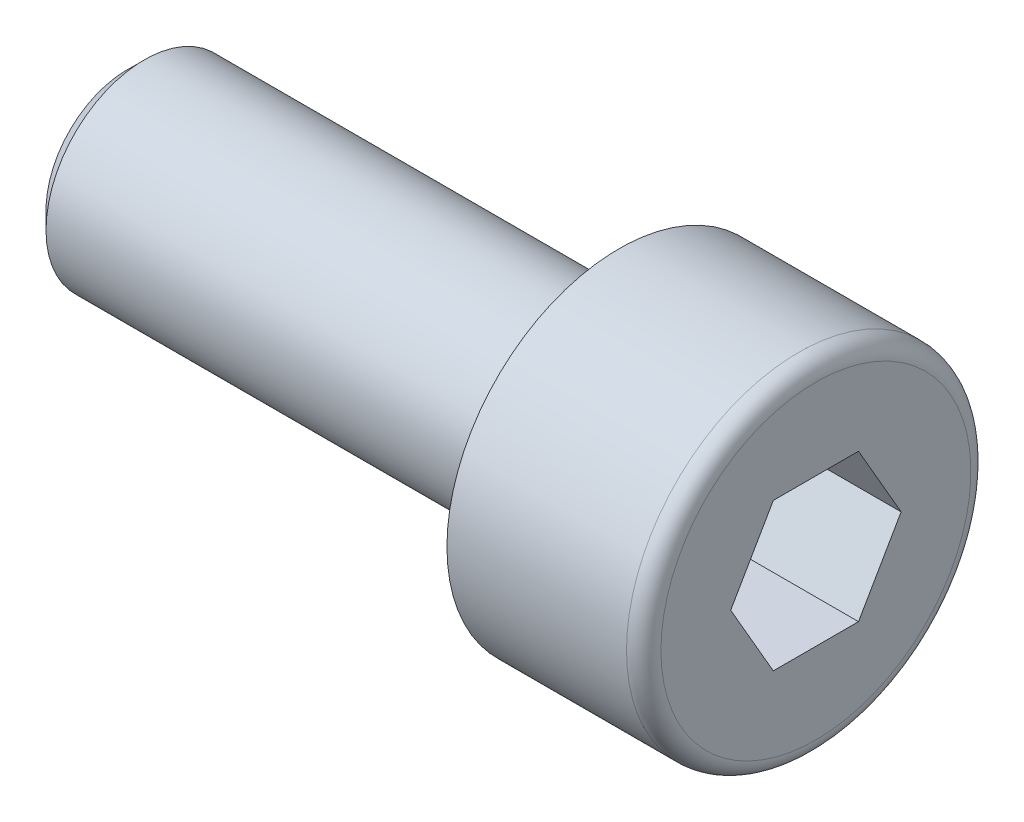
ISO-10303-21;
HEADER;
FILE_DESCRIPTION(('STEP AP214'),'2;1');
FILE_NAME('part.step','',(''),(''),'','','');
FILE_SCHEMA(('AUTOMOTIVE_DESIGN { 1 0 10303 214 1 1 1 1 }'));
ENDSEC;
DATA;
#1=APPLICATION_CONTEXT('core data for automotive mechanical design processes');
#2=APPLICATION_PROTOCOL_DEFINITION('international standard','automotive_design',2000,#1);
#3=PRODUCT_CONTEXT('',#1,'mechanical');
#4=PRODUCT('Part','Part','',(#3));
#5=PRODUCT_RELATED_PRODUCT_CATEGORY('part','',(#4));
#6=PRODUCT_DEFINITION_FORMATION('','',#4);
#7=PRODUCT_DEFINITION_CONTEXT('part definition',#1,'design');
#8=PRODUCT_DEFINITION('design','',#6,#7);
#9=PRODUCT_DEFINITION_SHAPE('','',#8);
#10=(LENGTH_UNIT() NAMED_UNIT(*) SI_UNIT(.MILLI.,.METRE.));
#11=(NAMED_UNIT(*) PLANE_ANGLE_UNIT() SI_UNIT($,.RADIAN.));
#12=(NAMED_UNIT(*) SI_UNIT($,.STERADIAN.) SOLID_ANGLE_UNIT());
#13=UNCERTAINTY_MEASURE_WITH_UNIT(LENGTH_MEASURE(1.E-05),#10,'distance_accuracy_value','');
#14=(GEOMETRIC_REPRESENTATION_CONTEXT(3) GLOBAL_UNCERTAINTY_ASSIGNED_CONTEXT((#13)) GLOBAL_UNIT_ASSIGNED_CONTEXT((#10,
#11,#12)) REPRESENTATION_CONTEXT('',''));
#15=CARTESIAN_POINT('',(0.,0.,0.));
#16=DIRECTION('',(0.,0.,1.));
#17=DIRECTION('',(1.,0.,0.));
#18=AXIS2_PLACEMENT_3D('',#15,#16,#17);
#19=CARTESIAN_POINT('',(0.,0.,0.));
#20=DIRECTION('',(-1.,0.,0.));
#21=DIRECTION('',(0.,0.,1.));
#22=AXIS2_PLACEMENT_3D('',#19,#20,#21);
#23=PLANE('',#22);
#24=DIRECTION('',(0.,0.866025403784438,0.5));
#25=VECTOR('',#24,1.);
#26=CARTESIAN_POINT('',(0.,0.,-1.73205080756888));
#27=LINE('',#26,#25);
#28=CARTESIAN_POINT('',(0.,0.,-1.73205080756888));
#29=VERTEX_POINT('',#28);
#30=CARTESIAN_POINT('',(0.,1.5,-0.866025403784438));
#31=VERTEX_POINT('',#30);
#32=EDGE_CURVE('E110',#29,#31,#27,.T.);
#33=ORIENTED_EDGE('',*,*,#32,.F.);
#34=DIRECTION('',(0.,0.866025403784438,-0.5));
#35=VECTOR('',#34,1.);
#36=CARTESIAN_POINT('',(0.,-1.5,-0.86602540378444));
#37=LINE('',#36,#35);
#38=CARTESIAN_POINT('',(0.,-1.5,-0.86602540378444));
#39=VERTEX_POINT('',#38);
#40=EDGE_CURVE('E52',#39,#29,#37,.T.);
#41=ORIENTED_EDGE('',*,*,#40,.F.);
#42=DIRECTION('',(0.,0.,-1.));
#43=VECTOR('',#42,1.);
#44=CARTESIAN_POINT('',(0.,-1.5,0.866025403784438));
#45=LINE('',#44,#43);
#46=CARTESIAN_POINT('',(0.,-1.5,0.866025403784438));
#47=VERTEX_POINT('',#46);
#48=EDGE_CURVE('E125',#47,#39,#45,.T.);
#49=ORIENTED_EDGE('',*,*,#48,.F.);
#50=DIRECTION('',(0.,-0.866025403784438,-0.5));
#51=VECTOR('',#50,1.);
#52=CARTESIAN_POINT('',(0.,0.,1.73205080756888));
#53=LINE('',#52,#51);
#54=CARTESIAN_POINT('',(0.,0.,1.73205080756888));
#55=VERTEX_POINT('',#54);
#56=EDGE_CURVE('E119',#55,#47,#53,.T.);
#57=ORIENTED_EDGE('',*,*,#56,.F.);
#58=DIRECTION('',(0.,-0.866025403784439,0.5));
#59=VECTOR('',#58,1.);
#60=CARTESIAN_POINT('',(0.,1.5,0.866025403784439));
#61=LINE('',#60,#59);
#62=CARTESIAN_POINT('',(0.,1.5,0.866025403784439));
#63=VERTEX_POINT('',#62);
#64=EDGE_CURVE('E117',#63,#55,#61,.T.);
#65=ORIENTED_EDGE('',*,*,#64,.F.);
#66=DIRECTION('',(0.,0.,1.));
#67=VECTOR('',#66,1.);
#68=CARTESIAN_POINT('',(0.,1.5,-0.866025403784438));
#69=LINE('',#68,#67);
#70=EDGE_CURVE('E103',#31,#63,#69,.T.);
#71=ORIENTED_EDGE('',*,*,#70,.F.);
#72=EDGE_LOOP('',(#33,#41,#49,#57,#65,#71));
#73=FACE_BOUND('',#72,.T.);
#74=CARTESIAN_POINT('',(0.,0.,0.));
#75=DIRECTION('',(-1.,0.,0.));
#76=DIRECTION('',(0.,0.,1.));
#77=AXIS2_PLACEMENT_3D('',#74,#75,#76);
#78=CIRCLE('',#77,3.15);
#79=CARTESIAN_POINT('',(0.,0.,3.15));
#80=VERTEX_POINT('',#79);
#81=EDGE_CURVE('E12',#80,#80,#78,.F.);
#82=ORIENTED_EDGE('',*,*,#81,.T.);
#83=EDGE_LOOP('',(#82));
#84=FACE_BOUND('',#83,.T.);
#85=ADVANCED_FACE('F37',(#73,#84),#23,.F.);
#86=CARTESIAN_POINT('',(-123.158940217391,0.,0.));
#87=DIRECTION('',(-1.,0.,0.));
#88=DIRECTION('',(0.,0.,1.));
#89=AXIS2_PLACEMENT_3D('',#86,#87,#88);
#90=CYLINDRICAL_SURFACE('',#89,3.5);
#91=CARTESIAN_POINT('',(-0.350000000000003,0.,0.));
#92=DIRECTION('',(-1.,0.,0.));
#93=DIRECTION('',(0.,0.,1.));
#94=AXIS2_PLACEMENT_3D('',#91,#92,#93);
#95=CIRCLE('',#94,3.5);
#96=CARTESIAN_POINT('',(-0.350000000000003,0.,3.5));
#97=VERTEX_POINT('',#96);
#98=EDGE_CURVE('E45',#97,#97,#95,.T.);
#99=ORIENTED_EDGE('',*,*,#98,.T.);
#100=EDGE_LOOP('',(#99));
#101=FACE_BOUND('',#100,.T.);
#102=CARTESIAN_POINT('',(-4.,0.,0.));
#103=DIRECTION('',(-1.,0.,0.));
#104=DIRECTION('',(0.,0.,1.));
#105=AXIS2_PLACEMENT_3D('',#102,#103,#104);
#106=CIRCLE('',#105,3.5);
#107=CARTESIAN_POINT('',(-4.,0.,3.5));
#108=VERTEX_POINT('',#107);
#109=EDGE_CURVE('E140',#108,#108,#106,.T.);
#110=ORIENTED_EDGE('',*,*,#109,.F.);
#111=EDGE_LOOP('',(#110));
#112=FACE_BOUND('',#111,.T.);
#113=ADVANCED_FACE('F151',(#101,#112),#90,.T.);
#114=CARTESIAN_POINT('',(-4.,3.5,0.));
#115=DIRECTION('',(1.,0.,0.));
#116=DIRECTION('',(0.,0.,-1.));
#117=AXIS2_PLACEMENT_3D('',#114,#115,#116);
#118=PLANE('',#117);
#119=CARTESIAN_POINT('',(-4.,0.,0.));
#120=DIRECTION('',(-1.,0.,0.));
#121=DIRECTION('',(0.,0.,1.));
#122=AXIS2_PLACEMENT_3D('',#119,#120,#121);
#123=CIRCLE('',#122,2.);
#124=CARTESIAN_POINT('',(-4.,0.,2.));
#125=VERTEX_POINT('',#124);
#126=EDGE_CURVE('E137',#125,#125,#123,.T.);
#127=ORIENTED_EDGE('',*,*,#126,.F.);
#128=EDGE_LOOP('',(#127));
#129=FACE_BOUND('',#128,.T.);
#130=ORIENTED_EDGE('',*,*,#109,.T.);
#131=EDGE_LOOP('',(#130));
#132=FACE_BOUND('',#131,.T.);
#133=ADVANCED_FACE('F172',(#129,#132),#118,.F.);
#134=CARTESIAN_POINT('',(-123.158940217391,0.,0.));
#135=DIRECTION('',(-1.,0.,0.));
#136=DIRECTION('',(0.,0.,1.));
#137=AXIS2_PLACEMENT_3D('',#134,#135,#136);
#138=CYLINDRICAL_SURFACE('',#137,2.);
#139=CARTESIAN_POINT('',(-13.65,0.,0.));
#140=DIRECTION('',(1.,0.,0.));
#141=DIRECTION('',(0.,0.,-1.));
#142=AXIS2_PLACEMENT_3D('',#139,#140,#141);
#143=CIRCLE('',#142,2.);
#144=CARTESIAN_POINT('',(-13.65,0.,-2.));
#145=VERTEX_POINT('',#144);
#146=EDGE_CURVE('E146',#145,#145,#143,.T.);
#147=ORIENTED_EDGE('',*,*,#146,.T.);
#148=EDGE_LOOP('',(#147));
#149=FACE_BOUND('',#148,.T.);
#150=ORIENTED_EDGE('',*,*,#126,.T.);
#151=EDGE_LOOP('',(#150));
#152=FACE_BOUND('',#151,.T.);
#153=ADVANCED_FACE('F177',(#149,#152),#138,.T.);
#154=CARTESIAN_POINT('',(-14.,2.,0.));
#155=DIRECTION('',(1.,0.,0.));
#156=DIRECTION('',(0.,0.,-1.));
#157=AXIS2_PLACEMENT_3D('',#154,#155,#156);
#158=PLANE('',#157);
#159=CARTESIAN_POINT('',(-14.,0.,0.));
#160=DIRECTION('',(1.,0.,0.));
#161=DIRECTION('',(0.,0.,-1.));
#162=AXIS2_PLACEMENT_3D('',#159,#160,#161);
#163=CIRCLE('',#162,1.64999999999999);
#164=CARTESIAN_POINT('',(-14.,0.,-1.64999999999999));
#165=VERTEX_POINT('',#164);
#166=EDGE_CURVE('E143',#165,#165,#163,.F.);
#167=ORIENTED_EDGE('',*,*,#166,.T.);
#168=EDGE_LOOP('',(#167));
#169=FACE_BOUND('',#168,.T.);
#170=ADVANCED_FACE('F164',(#169),#158,.F.);
#171=CARTESIAN_POINT('',(-14.,0.,0.));
#172=DIRECTION('',(1.,0.,0.));
#173=DIRECTION('',(0.,0.,-1.));
#174=AXIS2_PLACEMENT_3D('',#171,#172,#173);
#175=CONICAL_SURFACE('',#174,1.65,0.78539816339745);
#176=ORIENTED_EDGE('',*,*,#146,.F.);
#177=EDGE_LOOP('',(#176));
#178=FACE_BOUND('',#177,.T.);
#179=ORIENTED_EDGE('',*,*,#166,.F.);
#180=EDGE_LOOP('',(#179));
#181=FACE_BOUND('',#180,.T.);
#182=ADVANCED_FACE('F156',(#178,#181),#175,.T.);
#183=CARTESIAN_POINT('',(-0.350000000000003,0.,0.));
#184=DIRECTION('',(-1.,0.,0.));
#185=DIRECTION('',(0.,0.,1.));
#186=AXIS2_PLACEMENT_3D('',#183,#184,#185);
#187=TOROIDAL_SURFACE('',#186,3.15,0.35);
#188=ORIENTED_EDGE('',*,*,#81,.F.);
#189=EDGE_LOOP('',(#188));
#190=FACE_BOUND('',#189,.T.);
#191=ORIENTED_EDGE('',*,*,#98,.F.);
#192=EDGE_LOOP('',(#191));
#193=FACE_BOUND('',#192,.T.);
#194=ADVANCED_FACE('F39',(#190,#193),#187,.T.);
#195=CARTESIAN_POINT('',(-8.58257569495584,-1.5,-0.86602540378444));
#196=DIRECTION('',(0.,-0.5,-0.866025403784439));
#197=DIRECTION('',(0.,0.866025403784439,-0.5));
#198=AXIS2_PLACEMENT_3D('',#195,#196,#197);
#199=PLANE('',#198);
#200=DIRECTION('',(0.,-0.866025403784439,0.5));
#201=VECTOR('',#200,1.);
#202=CARTESIAN_POINT('',(-3.,-1.5,-0.86602540378444));
#203=LINE('',#202,#201);
#204=CARTESIAN_POINT('',(-3.,0.,-1.73205080756888));
#205=VERTEX_POINT('',#204);
#206=CARTESIAN_POINT('',(-3.,-1.5,-0.86602540378444));
#207=VERTEX_POINT('',#206);
#208=EDGE_CURVE('E71',#205,#207,#203,.T.);
#209=ORIENTED_EDGE('',*,*,#208,.T.);
#210=DIRECTION('',(1.,0.,0.));
#211=VECTOR('',#210,1.);
#212=CARTESIAN_POINT('',(-8.58257569495584,-1.5,-0.86602540378444));
#213=LINE('',#212,#211);
#214=EDGE_CURVE('E128',#207,#39,#213,.T.);
#215=ORIENTED_EDGE('',*,*,#214,.T.);
#216=ORIENTED_EDGE('',*,*,#40,.T.);
#217=DIRECTION('',(1.,0.,0.));
#218=VECTOR('',#217,1.);
#219=CARTESIAN_POINT('',(-8.58257569495584,0.,-1.73205080756888));
#220=LINE('',#219,#218);
#221=EDGE_CURVE('E107',#205,#29,#220,.T.);
#222=ORIENTED_EDGE('',*,*,#221,.F.);
#223=EDGE_LOOP('',(#209,#215,#216,#222));
#224=FACE_BOUND('',#223,.T.);
#225=ADVANCED_FACE('F155',(#224),#199,.F.);
#226=CARTESIAN_POINT('',(-8.58257569495584,-1.5,0.866025403784438));
#227=DIRECTION('',(0.,-1.,0.));
#228=DIRECTION('',(0.,0.,-1.));
#229=AXIS2_PLACEMENT_3D('',#226,#227,#228);
#230=PLANE('',#229);
#231=DIRECTION('',(0.,0.,1.));
#232=VECTOR('',#231,1.);
#233=CARTESIAN_POINT('',(-3.,-1.5,0.866025403784438));
#234=LINE('',#233,#232);
#235=CARTESIAN_POINT('',(-3.,-1.5,0.866025403784438));
#236=VERTEX_POINT('',#235);
#237=EDGE_CURVE('E205',#207,#236,#234,.T.);
#238=ORIENTED_EDGE('',*,*,#237,.T.);
#239=DIRECTION('',(1.,0.,0.));
#240=VECTOR('',#239,1.);
#241=CARTESIAN_POINT('',(-8.58257569495584,-1.5,0.866025403784438));
#242=LINE('',#241,#240);
#243=EDGE_CURVE('E130',#236,#47,#242,.T.);
#244=ORIENTED_EDGE('',*,*,#243,.T.);
#245=ORIENTED_EDGE('',*,*,#48,.T.);
#246=ORIENTED_EDGE('',*,*,#214,.F.);
#247=EDGE_LOOP('',(#238,#244,#245,#246));
#248=FACE_BOUND('',#247,.T.);
#249=ADVANCED_FACE('F162',(#248),#230,.F.);
#250=CARTESIAN_POINT('',(-8.58257569495584,0.,1.73205080756888));
#251=DIRECTION('',(0.,-0.5,0.866025403784438));
#252=DIRECTION('',(0.,-0.866025403784438,-0.5));
#253=AXIS2_PLACEMENT_3D('',#250,#251,#252);
#254=PLANE('',#253);
#255=DIRECTION('',(0.,0.866025403784438,0.5));
#256=VECTOR('',#255,1.);
#257=CARTESIAN_POINT('',(-3.,0.,1.73205080756888));
#258=LINE('',#257,#256);
#259=CARTESIAN_POINT('',(-3.,0.,1.73205080756888));
#260=VERTEX_POINT('',#259);
#261=EDGE_CURVE('E208',#236,#260,#258,.T.);
#262=ORIENTED_EDGE('',*,*,#261,.T.);
#263=DIRECTION('',(1.,0.,0.));
#264=VECTOR('',#263,1.);
#265=CARTESIAN_POINT('',(-8.58257569495584,0.,1.73205080756888));
#266=LINE('',#265,#264);
#267=EDGE_CURVE('E132',#260,#55,#266,.T.);
#268=ORIENTED_EDGE('',*,*,#267,.T.);
#269=ORIENTED_EDGE('',*,*,#56,.T.);
#270=ORIENTED_EDGE('',*,*,#243,.F.);
#271=EDGE_LOOP('',(#262,#268,#269,#270));
#272=FACE_BOUND('',#271,.T.);
#273=ADVANCED_FACE('F193',(#272),#254,.F.);
#274=CARTESIAN_POINT('',(-8.58257569495584,1.5,0.866025403784439));
#275=DIRECTION('',(0.,0.5,0.866025403784439));
#276=DIRECTION('',(0.,-0.866025403784439,0.5));
#277=AXIS2_PLACEMENT_3D('',#274,#275,#276);
#278=PLANE('',#277);
#279=DIRECTION('',(0.,0.866025403784439,-0.5));
#280=VECTOR('',#279,1.);
#281=CARTESIAN_POINT('',(-3.,1.5,0.866025403784439));
#282=LINE('',#281,#280);
#283=CARTESIAN_POINT('',(-3.,1.5,0.866025403784439));
#284=VERTEX_POINT('',#283);
#285=EDGE_CURVE('E61',#260,#284,#282,.T.);
#286=ORIENTED_EDGE('',*,*,#285,.T.);
#287=DIRECTION('',(1.,0.,0.));
#288=VECTOR('',#287,1.);
#289=CARTESIAN_POINT('',(-8.58257569495584,1.5,0.866025403784439));
#290=LINE('',#289,#288);
#291=EDGE_CURVE('E106',#284,#63,#290,.T.);
#292=ORIENTED_EDGE('',*,*,#291,.T.);
#293=ORIENTED_EDGE('',*,*,#64,.T.);
#294=ORIENTED_EDGE('',*,*,#267,.F.);
#295=EDGE_LOOP('',(#286,#292,#293,#294));
#296=FACE_BOUND('',#295,.T.);
#297=ADVANCED_FACE('F190',(#296),#278,.F.);
#298=CARTESIAN_POINT('',(-8.58257569495584,1.5,-0.866025403784438));
#299=DIRECTION('',(0.,1.,0.));
#300=DIRECTION('',(0.,0.,1.));
#301=AXIS2_PLACEMENT_3D('',#298,#299,#300);
#302=PLANE('',#301);
#303=DIRECTION('',(0.,0.,-1.));
#304=VECTOR('',#303,1.);
#305=CARTESIAN_POINT('',(-3.,1.5,-0.866025403784438));
#306=LINE('',#305,#304);
#307=CARTESIAN_POINT('',(-3.,1.5,-0.866025403784438));
#308=VERTEX_POINT('',#307);
#309=EDGE_CURVE('E105',#284,#308,#306,.T.);
#310=ORIENTED_EDGE('',*,*,#309,.T.);
#311=DIRECTION('',(1.,0.,0.));
#312=VECTOR('',#311,1.);
#313=CARTESIAN_POINT('',(-8.58257569495584,1.5,-0.866025403784438));
#314=LINE('',#313,#312);
#315=EDGE_CURVE('E98',#308,#31,#314,.T.);
#316=ORIENTED_EDGE('',*,*,#315,.T.);
#317=ORIENTED_EDGE('',*,*,#70,.T.);
#318=ORIENTED_EDGE('',*,*,#291,.F.);
#319=EDGE_LOOP('',(#310,#316,#317,#318));
#320=FACE_BOUND('',#319,.T.);
#321=ADVANCED_FACE('F100',(#320),#302,.F.);
#322=CARTESIAN_POINT('',(-8.58257569495584,0.,-1.73205080756888));
#323=DIRECTION('',(0.,0.5,-0.866025403784438));
#324=DIRECTION('',(0.,0.866025403784439,0.5));
#325=AXIS2_PLACEMENT_3D('',#322,#323,#324);
#326=PLANE('',#325);
#327=DIRECTION('',(0.,-0.866025403784439,-0.5));
#328=VECTOR('',#327,1.);
#329=CARTESIAN_POINT('',(-3.,0.,-1.73205080756888));
#330=LINE('',#329,#328);
#331=EDGE_CURVE('E80',#308,#205,#330,.T.);
#332=ORIENTED_EDGE('',*,*,#331,.T.);
#333=ORIENTED_EDGE('',*,*,#221,.T.);
#334=ORIENTED_EDGE('',*,*,#32,.T.);
#335=ORIENTED_EDGE('',*,*,#315,.F.);
#336=EDGE_LOOP('',(#332,#333,#334,#335));
#337=FACE_BOUND('',#336,.T.);
#338=ADVANCED_FACE('F111',(#337),#326,.F.);
#339=CARTESIAN_POINT('',(-3.,3.5,0.));
#340=DIRECTION('',(1.,0.,0.));
#341=DIRECTION('',(0.,0.,-1.));
#342=AXIS2_PLACEMENT_3D('',#339,#340,#341);
#343=PLANE('',#342);
#344=ORIENTED_EDGE('',*,*,#208,.F.);
#345=ORIENTED_EDGE('',*,*,#331,.F.);
#346=ORIENTED_EDGE('',*,*,#309,.F.);
#347=ORIENTED_EDGE('',*,*,#285,.F.);
#348=ORIENTED_EDGE('',*,*,#261,.F.);
#349=ORIENTED_EDGE('',*,*,#237,.F.);
#350=EDGE_LOOP('',(#344,#345,#346,#347,#348,#349));
#351=FACE_BOUND('',#350,.T.);
#352=ADVANCED_FACE('F187',(#351),#343,.T.);
#353=CLOSED_SHELL('',(#85,#113,#133,#153,#170,#182,#194,#225,#249,#273,#297,#321,#338,#352));
#354=MANIFOLD_SOLID_BREP('B2',#353);
#355=ADVANCED_BREP_SHAPE_REPRESENTATION('',(#18,#354),#14);
#356=SHAPE_DEFINITION_REPRESENTATION(#9,#355);
ENDSEC;
END-ISO-10303-21;
